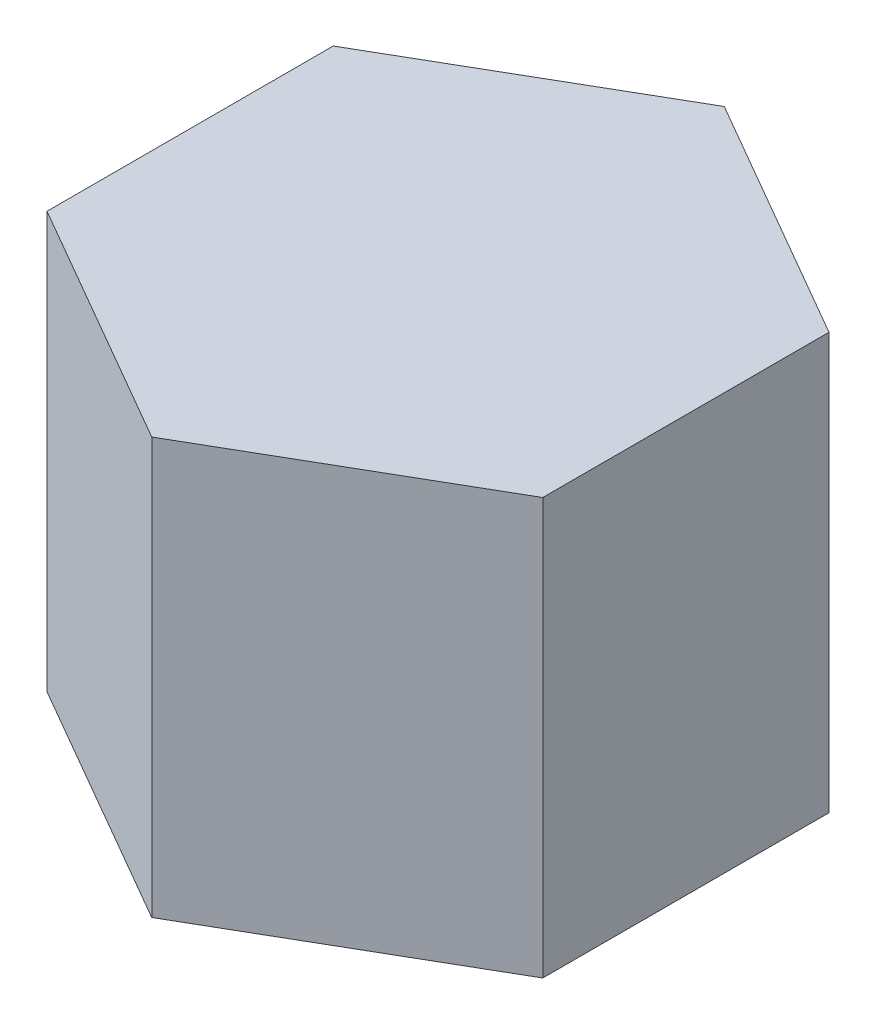
ISO-10303-21;
HEADER;
FILE_DESCRIPTION(('STEP AP214'),'2;1');
FILE_NAME('part.step','',(''),(''),'','','');
FILE_SCHEMA(('AUTOMOTIVE_DESIGN { 1 0 10303 214 1 1 1 1 }'));
ENDSEC;
DATA;
#1=APPLICATION_CONTEXT('core data for automotive mechanical design processes');
#2=APPLICATION_PROTOCOL_DEFINITION('international standard','automotive_design',2000,#1);
#3=PRODUCT_CONTEXT('',#1,'mechanical');
#4=PRODUCT('Part','Part','',(#3));
#5=PRODUCT_RELATED_PRODUCT_CATEGORY('part','',(#4));
#6=PRODUCT_DEFINITION_FORMATION('','',#4);
#7=PRODUCT_DEFINITION_CONTEXT('part definition',#1,'design');
#8=PRODUCT_DEFINITION('design','',#6,#7);
#9=PRODUCT_DEFINITION_SHAPE('','',#8);
#10=(LENGTH_UNIT() NAMED_UNIT(*) SI_UNIT(.MILLI.,.METRE.));
#11=(NAMED_UNIT(*) PLANE_ANGLE_UNIT() SI_UNIT($,.RADIAN.));
#12=(NAMED_UNIT(*) SI_UNIT($,.STERADIAN.) SOLID_ANGLE_UNIT());
#13=UNCERTAINTY_MEASURE_WITH_UNIT(LENGTH_MEASURE(1.E-05),#10,'distance_accuracy_value','');
#14=(GEOMETRIC_REPRESENTATION_CONTEXT(3) GLOBAL_UNCERTAINTY_ASSIGNED_CONTEXT((#13)) GLOBAL_UNIT_ASSIGNED_CONTEXT((#10,
#11,#12)) REPRESENTATION_CONTEXT('',''));
#15=CARTESIAN_POINT('',(0.,0.,0.));
#16=DIRECTION('',(0.,0.,1.));
#17=DIRECTION('',(1.,0.,0.));
#18=AXIS2_PLACEMENT_3D('',#15,#16,#17);
#19=CARTESIAN_POINT('',(205.339551417382,-147.556598747966,289.949920412926));
#20=DIRECTION('',(-0.499999999999943,0.,-0.866025403784471));
#21=DIRECTION('',(-0.866025403784471,0.,0.499999999999943));
#22=AXIS2_PLACEMENT_3D('',#19,#20,#21);
#23=PLANE('',#22);
#24=CARTESIAN_POINT('',(205.642660308706,-147.047793579175,289.774920412926));
#25=DIRECTION('',(-0.866025403784471,0.,0.499999999999943));
#26=VECTOR('',#25,1.);
#27=LINE('',#24,#26);
#28=CARTESIAN_POINT('',(205.642660308706,-147.047793579175,289.774920412926));
#29=VERTEX_POINT('',#28);
#30=CARTESIAN_POINT('',(205.339551417382,-147.047793579175,289.949920412926));
#31=VERTEX_POINT('',#30);
#32=EDGE_CURVE('E170',#29,#31,#27,.T.);
#33=ORIENTED_EDGE('',*,*,#32,.T.);
#34=CARTESIAN_POINT('',(205.339551417382,-147.556598747966,289.949920412926));
#35=DIRECTION('',(0.,1.,0.));
#36=VECTOR('',#35,1.);
#37=LINE('',#34,#36);
#38=CARTESIAN_POINT('',(205.339551417382,-147.556598747966,289.949920412926));
#39=VERTEX_POINT('',#38);
#40=EDGE_CURVE('E35',#39,#31,#37,.T.);
#41=ORIENTED_EDGE('',*,*,#40,.F.);
#42=CARTESIAN_POINT('',(205.642660308706,-147.556598747966,289.774920412926));
#43=DIRECTION('',(-0.866025403784471,0.,0.499999999999943));
#44=VECTOR('',#43,1.);
#45=LINE('',#42,#44);
#46=CARTESIAN_POINT('',(205.642660308706,-147.556598747966,289.774920412926));
#47=VERTEX_POINT('',#46);
#48=EDGE_CURVE('E159',#47,#39,#45,.T.);
#49=ORIENTED_EDGE('',*,*,#48,.F.);
#50=CARTESIAN_POINT('',(205.642660308706,-147.556598747966,289.774920412926));
#51=DIRECTION('',(0.,1.,0.));
#52=VECTOR('',#51,1.);
#53=LINE('',#50,#52);
#54=EDGE_CURVE('E10',#47,#29,#53,.T.);
#55=ORIENTED_EDGE('',*,*,#54,.T.);
#56=EDGE_LOOP('',(#33,#41,#49,#55));
#57=FACE_BOUND('',#56,.T.);
#58=ADVANCED_FACE('F16',(#57),#23,.F.);
#59=CARTESIAN_POINT('',(205.642660308706,-147.556598747966,291.594471220494));
#60=DIRECTION('',(-1.,0.,0.));
#61=DIRECTION('',(0.,-1.,0.));
#62=AXIS2_PLACEMENT_3D('',#59,#60,#61);
#63=PLANE('',#62);
#64=CARTESIAN_POINT('',(205.642660308706,-147.047793579175,289.424920412926));
#65=DIRECTION('',(0.,0.,1.));
#66=VECTOR('',#65,1.);
#67=LINE('',#64,#66);
#68=CARTESIAN_POINT('',(205.642660308706,-147.047793579175,289.424920412926));
#69=VERTEX_POINT('',#68);
#70=EDGE_CURVE('E167',#69,#29,#67,.T.);
#71=ORIENTED_EDGE('',*,*,#70,.T.);
#72=ORIENTED_EDGE('',*,*,#54,.F.);
#73=CARTESIAN_POINT('',(205.642660308706,-147.556598747966,289.424920412926));
#74=DIRECTION('',(0.,0.,1.));
#75=VECTOR('',#74,1.);
#76=LINE('',#73,#75);
#77=CARTESIAN_POINT('',(205.642660308706,-147.556598747966,289.424920412926));
#78=VERTEX_POINT('',#77);
#79=EDGE_CURVE('E156',#78,#47,#76,.T.);
#80=ORIENTED_EDGE('',*,*,#79,.F.);
#81=CARTESIAN_POINT('',(205.642660308706,-147.556598747966,289.424920412926));
#82=DIRECTION('',(0.,1.,0.));
#83=VECTOR('',#82,1.);
#84=LINE('',#81,#83);
#85=EDGE_CURVE('E27',#78,#69,#84,.T.);
#86=ORIENTED_EDGE('',*,*,#85,.T.);
#87=EDGE_LOOP('',(#71,#72,#80,#86));
#88=FACE_BOUND('',#87,.T.);
#89=ADVANCED_FACE('F189',(#88),#63,.F.);
#90=CARTESIAN_POINT('',(205.642660308706,-147.556598747966,289.424920412926));
#91=DIRECTION('',(-0.499999999999943,0.,0.866025403784471));
#92=DIRECTION('',(0.866025403784471,0.,0.499999999999943));
#93=AXIS2_PLACEMENT_3D('',#90,#91,#92);
#94=PLANE('',#93);
#95=CARTESIAN_POINT('',(205.339551417382,-147.047793579175,289.249920412926));
#96=DIRECTION('',(0.866025403784471,0.,0.499999999999943));
#97=VECTOR('',#96,1.);
#98=LINE('',#95,#97);
#99=CARTESIAN_POINT('',(205.339551417382,-147.047793579175,289.249920412926));
#100=VERTEX_POINT('',#99);
#101=EDGE_CURVE('E163',#100,#69,#98,.T.);
#102=ORIENTED_EDGE('',*,*,#101,.T.);
#103=ORIENTED_EDGE('',*,*,#85,.F.);
#104=CARTESIAN_POINT('',(205.339551417382,-147.556598747966,289.249920412926));
#105=DIRECTION('',(0.866025403784471,0.,0.499999999999943));
#106=VECTOR('',#105,1.);
#107=LINE('',#104,#106);
#108=CARTESIAN_POINT('',(205.339551417382,-147.556598747966,289.249920412926));
#109=VERTEX_POINT('',#108);
#110=EDGE_CURVE('E106',#109,#78,#107,.T.);
#111=ORIENTED_EDGE('',*,*,#110,.F.);
#112=CARTESIAN_POINT('',(205.339551417382,-147.556598747966,289.249920412926));
#113=DIRECTION('',(0.,1.,0.));
#114=VECTOR('',#113,1.);
#115=LINE('',#112,#114);
#116=EDGE_CURVE('E94',#109,#100,#115,.T.);
#117=ORIENTED_EDGE('',*,*,#116,.T.);
#118=EDGE_LOOP('',(#102,#103,#111,#117));
#119=FACE_BOUND('',#118,.T.);
#120=ADVANCED_FACE('F198',(#119),#94,.F.);
#121=CARTESIAN_POINT('',(205.339551417382,-147.556598747966,289.249920412926));
#122=DIRECTION('',(0.499999999999978,0.,0.866025403784452));
#123=DIRECTION('',(0.866025403784452,0.,-0.499999999999978));
#124=AXIS2_PLACEMENT_3D('',#121,#122,#123);
#125=PLANE('',#124);
#126=CARTESIAN_POINT('',(205.036442526057,-147.047793579175,289.424920412926));
#127=DIRECTION('',(0.866025403784452,0.,-0.499999999999978));
#128=VECTOR('',#127,1.);
#129=LINE('',#126,#128);
#130=CARTESIAN_POINT('',(205.036442526057,-147.047793579175,289.424920412926));
#131=VERTEX_POINT('',#130);
#132=EDGE_CURVE('E162',#131,#100,#129,.T.);
#133=ORIENTED_EDGE('',*,*,#132,.T.);
#134=ORIENTED_EDGE('',*,*,#116,.F.);
#135=CARTESIAN_POINT('',(205.036442526057,-147.556598747966,289.424920412926));
#136=DIRECTION('',(0.866025403784452,0.,-0.499999999999978));
#137=VECTOR('',#136,1.);
#138=LINE('',#135,#137);
#139=CARTESIAN_POINT('',(205.036442526057,-147.556598747966,289.424920412926));
#140=VERTEX_POINT('',#139);
#141=EDGE_CURVE('E98',#140,#109,#138,.T.);
#142=ORIENTED_EDGE('',*,*,#141,.F.);
#143=CARTESIAN_POINT('',(205.036442526057,-147.556598747966,289.424920412926));
#144=DIRECTION('',(0.,1.,0.));
#145=VECTOR('',#144,1.);
#146=LINE('',#143,#145);
#147=EDGE_CURVE('E79',#140,#131,#146,.T.);
#148=ORIENTED_EDGE('',*,*,#147,.T.);
#149=EDGE_LOOP('',(#133,#134,#142,#148));
#150=FACE_BOUND('',#149,.T.);
#151=ADVANCED_FACE('F100',(#150),#125,.F.);
#152=CARTESIAN_POINT('',(205.036442526057,-147.556598747966,291.594471220494));
#153=DIRECTION('',(1.,0.,0.));
#154=DIRECTION('',(0.,1.,0.));
#155=AXIS2_PLACEMENT_3D('',#152,#153,#154);
#156=PLANE('',#155);
#157=CARTESIAN_POINT('',(205.036442526057,-147.047793579175,289.774920412926));
#158=DIRECTION('',(0.,0.,-1.));
#159=VECTOR('',#158,1.);
#160=LINE('',#157,#159);
#161=CARTESIAN_POINT('',(205.036442526057,-147.047793579175,289.774920412926));
#162=VERTEX_POINT('',#161);
#163=EDGE_CURVE('E88',#162,#131,#160,.T.);
#164=ORIENTED_EDGE('',*,*,#163,.T.);
#165=ORIENTED_EDGE('',*,*,#147,.F.);
#166=CARTESIAN_POINT('',(205.036442526057,-147.556598747966,289.774920412926));
#167=DIRECTION('',(0.,0.,-1.));
#168=VECTOR('',#167,1.);
#169=LINE('',#166,#168);
#170=CARTESIAN_POINT('',(205.036442526057,-147.556598747966,289.774920412926));
#171=VERTEX_POINT('',#170);
#172=EDGE_CURVE('E84',#171,#140,#169,.T.);
#173=ORIENTED_EDGE('',*,*,#172,.F.);
#174=CARTESIAN_POINT('',(205.036442526057,-147.556598747966,289.774920412926));
#175=DIRECTION('',(0.,1.,0.));
#176=VECTOR('',#175,1.);
#177=LINE('',#174,#176);
#178=EDGE_CURVE('E58',#171,#162,#177,.T.);
#179=ORIENTED_EDGE('',*,*,#178,.T.);
#180=EDGE_LOOP('',(#164,#165,#173,#179));
#181=FACE_BOUND('',#180,.T.);
#182=ADVANCED_FACE('F82',(#181),#156,.F.);
#183=CARTESIAN_POINT('',(205.036442526057,-147.556598747966,289.774920412926));
#184=DIRECTION('',(0.499999999999943,0.,-0.866025403784471));
#185=DIRECTION('',(-0.866025403784471,0.,-0.499999999999943));
#186=AXIS2_PLACEMENT_3D('',#183,#184,#185);
#187=PLANE('',#186);
#188=CARTESIAN_POINT('',(205.339551417382,-147.047793579175,289.949920412926));
#189=DIRECTION('',(-0.866025403784471,0.,-0.499999999999943));
#190=VECTOR('',#189,1.);
#191=LINE('',#188,#190);
#192=EDGE_CURVE('E160',#31,#162,#191,.T.);
#193=ORIENTED_EDGE('',*,*,#192,.T.);
#194=ORIENTED_EDGE('',*,*,#178,.F.);
#195=CARTESIAN_POINT('',(205.339551417382,-147.556598747966,289.949920412926));
#196=DIRECTION('',(-0.866025403784471,0.,-0.499999999999943));
#197=VECTOR('',#196,1.);
#198=LINE('',#195,#197);
#199=EDGE_CURVE('E112',#39,#171,#198,.T.);
#200=ORIENTED_EDGE('',*,*,#199,.F.);
#201=ORIENTED_EDGE('',*,*,#40,.T.);
#202=EDGE_LOOP('',(#193,#194,#200,#201));
#203=FACE_BOUND('',#202,.T.);
#204=ADVANCED_FACE('F131',(#203),#187,.F.);
#205=CARTESIAN_POINT('',(206.491105863044,-147.556598747966,291.594471220494));
#206=DIRECTION('',(0.,1.,0.));
#207=DIRECTION('',(-1.,0.,0.));
#208=AXIS2_PLACEMENT_3D('',#205,#206,#207);
#209=PLANE('',#208);
#210=ORIENTED_EDGE('',*,*,#48,.T.);
#211=ORIENTED_EDGE('',*,*,#199,.T.);
#212=ORIENTED_EDGE('',*,*,#172,.T.);
#213=ORIENTED_EDGE('',*,*,#141,.T.);
#214=ORIENTED_EDGE('',*,*,#110,.T.);
#215=ORIENTED_EDGE('',*,*,#79,.T.);
#216=EDGE_LOOP('',(#210,#211,#212,#213,#214,#215));
#217=FACE_BOUND('',#216,.T.);
#218=ADVANCED_FACE('F111',(#217),#209,.F.);
#219=CARTESIAN_POINT('',(206.491105863044,-147.047793579175,291.594471220494));
#220=DIRECTION('',(0.,1.,0.));
#221=DIRECTION('',(-1.,0.,0.));
#222=AXIS2_PLACEMENT_3D('',#219,#220,#221);
#223=PLANE('',#222);
#224=ORIENTED_EDGE('',*,*,#32,.F.);
#225=ORIENTED_EDGE('',*,*,#70,.F.);
#226=ORIENTED_EDGE('',*,*,#101,.F.);
#227=ORIENTED_EDGE('',*,*,#132,.F.);
#228=ORIENTED_EDGE('',*,*,#163,.F.);
#229=ORIENTED_EDGE('',*,*,#192,.F.);
#230=EDGE_LOOP('',(#224,#225,#226,#227,#228,#229));
#231=FACE_BOUND('',#230,.T.);
#232=ADVANCED_FACE('F130',(#231),#223,.T.);
#233=CLOSED_SHELL('',(#58,#89,#120,#151,#182,#204,#218,#232));
#234=MANIFOLD_SOLID_BREP('B1',#233);
#235=ADVANCED_BREP_SHAPE_REPRESENTATION('',(#18,#234),#14);
#236=SHAPE_DEFINITION_REPRESENTATION(#9,#235);
ENDSEC;
END-ISO-10303-21;
